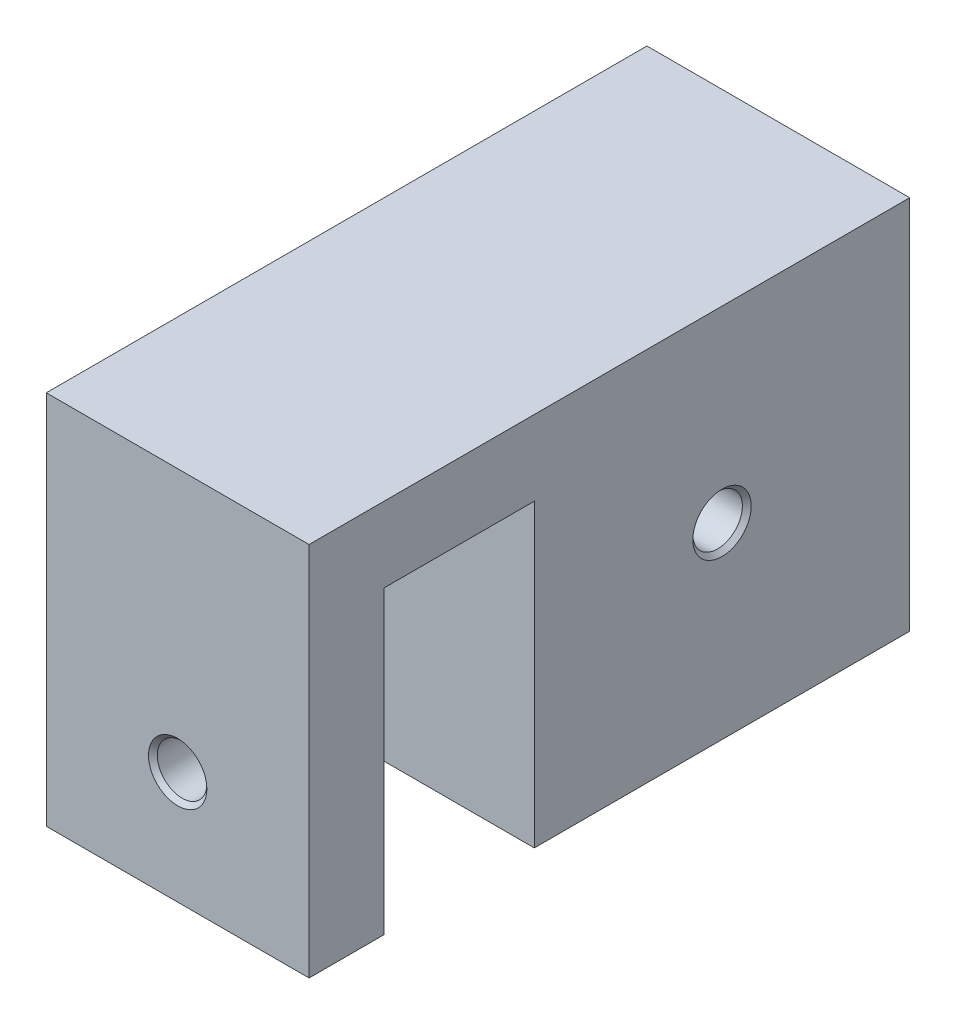
ISO-10303-21;
HEADER;
FILE_DESCRIPTION(('STEP AP214'),'2;1');
FILE_NAME('part.step','',(''),(''),'','','');
FILE_SCHEMA(('AUTOMOTIVE_DESIGN { 1 0 10303 214 1 1 1 1 }'));
ENDSEC;
DATA;
#1=APPLICATION_CONTEXT('core data for automotive mechanical design processes');
#2=APPLICATION_PROTOCOL_DEFINITION('international standard','automotive_design',2000,#1);
#3=PRODUCT_CONTEXT('',#1,'mechanical');
#4=PRODUCT('Part','Part','',(#3));
#5=PRODUCT_RELATED_PRODUCT_CATEGORY('part','',(#4));
#6=PRODUCT_DEFINITION_FORMATION('','',#4);
#7=PRODUCT_DEFINITION_CONTEXT('part definition',#1,'design');
#8=PRODUCT_DEFINITION('design','',#6,#7);
#9=PRODUCT_DEFINITION_SHAPE('','',#8);
#10=(LENGTH_UNIT() NAMED_UNIT(*) SI_UNIT(.MILLI.,.METRE.));
#11=(NAMED_UNIT(*) PLANE_ANGLE_UNIT() SI_UNIT($,.RADIAN.));
#12=(NAMED_UNIT(*) SI_UNIT($,.STERADIAN.) SOLID_ANGLE_UNIT());
#13=UNCERTAINTY_MEASURE_WITH_UNIT(LENGTH_MEASURE(1.E-05),#10,'distance_accuracy_value','');
#14=(GEOMETRIC_REPRESENTATION_CONTEXT(3) GLOBAL_UNCERTAINTY_ASSIGNED_CONTEXT((#13)) GLOBAL_UNIT_ASSIGNED_CONTEXT((#10,
#11,#12)) REPRESENTATION_CONTEXT('',''));
#15=CARTESIAN_POINT('',(0.,0.,0.));
#16=DIRECTION('',(0.,0.,1.));
#17=DIRECTION('',(1.,0.,0.));
#18=AXIS2_PLACEMENT_3D('',#15,#16,#17);
#19=CARTESIAN_POINT('',(35.,-10.,30.));
#20=DIRECTION('',(0.,1.,0.));
#21=DIRECTION('',(-1.,0.,0.));
#22=AXIS2_PLACEMENT_3D('',#19,#20,#21);
#23=PLANE('',#22);
#24=DIRECTION('',(1.,0.,0.));
#25=VECTOR('',#24,1.);
#26=CARTESIAN_POINT('',(0.,-10.,20.));
#27=LINE('',#26,#25);
#28=CARTESIAN_POINT('',(0.,-10.,20.));
#29=VERTEX_POINT('',#28);
#30=CARTESIAN_POINT('',(35.,-10.,20.));
#31=VERTEX_POINT('',#30);
#32=EDGE_CURVE('E140',#29,#31,#27,.T.);
#33=ORIENTED_EDGE('',*,*,#32,.F.);
#34=DIRECTION('',(0.,0.,-1.));
#35=VECTOR('',#34,1.);
#36=CARTESIAN_POINT('',(0.,-10.,30.));
#37=LINE('',#36,#35);
#38=CARTESIAN_POINT('',(0.,-10.,0.));
#39=VERTEX_POINT('',#38);
#40=EDGE_CURVE('E59',#29,#39,#37,.T.);
#41=ORIENTED_EDGE('',*,*,#40,.T.);
#42=DIRECTION('',(1.,0.,0.));
#43=VECTOR('',#42,1.);
#44=CARTESIAN_POINT('',(35.,-10.,0.));
#45=LINE('',#44,#43);
#46=CARTESIAN_POINT('',(35.,-10.,0.));
#47=VERTEX_POINT('',#46);
#48=EDGE_CURVE('E145',#39,#47,#45,.T.);
#49=ORIENTED_EDGE('',*,*,#48,.T.);
#50=DIRECTION('',(0.,0.,-1.));
#51=VECTOR('',#50,1.);
#52=CARTESIAN_POINT('',(35.,-10.,30.));
#53=LINE('',#52,#51);
#54=EDGE_CURVE('E163',#31,#47,#53,.T.);
#55=ORIENTED_EDGE('',*,*,#54,.F.);
#56=EDGE_LOOP('',(#33,#41,#49,#55));
#57=FACE_BOUND('',#56,.T.);
#58=ADVANCED_FACE('F41',(#57),#23,.F.);
#59=CARTESIAN_POINT('',(35.,0.,0.));
#60=DIRECTION('',(0.,0.,-1.));
#61=DIRECTION('',(0.,1.,0.));
#62=AXIS2_PLACEMENT_3D('',#59,#60,#61);
#63=PLANE('',#62);
#64=ORIENTED_EDGE('',*,*,#48,.F.);
#65=DIRECTION('',(0.,-1.,0.));
#66=VECTOR('',#65,1.);
#67=CARTESIAN_POINT('',(0.,0.,0.));
#68=LINE('',#67,#66);
#69=CARTESIAN_POINT('',(0.,-50.,0.));
#70=VERTEX_POINT('',#69);
#71=EDGE_CURVE('E182',#39,#70,#68,.T.);
#72=ORIENTED_EDGE('',*,*,#71,.T.);
#73=DIRECTION('',(-1.,0.,0.));
#74=VECTOR('',#73,1.);
#75=CARTESIAN_POINT('',(35.,-50.,0.));
#76=LINE('',#75,#74);
#77=CARTESIAN_POINT('',(35.,-50.,0.));
#78=VERTEX_POINT('',#77);
#79=EDGE_CURVE('E11',#78,#70,#76,.T.);
#80=ORIENTED_EDGE('',*,*,#79,.F.);
#81=DIRECTION('',(0.,-1.,0.));
#82=VECTOR('',#81,1.);
#83=CARTESIAN_POINT('',(35.,0.,0.));
#84=LINE('',#83,#82);
#85=EDGE_CURVE('E90',#47,#78,#84,.T.);
#86=ORIENTED_EDGE('',*,*,#85,.F.);
#87=EDGE_LOOP('',(#64,#72,#80,#86));
#88=FACE_BOUND('',#87,.T.);
#89=ADVANCED_FACE('F43',(#88),#63,.F.);
#90=CARTESIAN_POINT('',(35.,-50.,0.));
#91=DIRECTION('',(0.,1.,0.));
#92=DIRECTION('',(0.,0.,1.));
#93=AXIS2_PLACEMENT_3D('',#90,#91,#92);
#94=PLANE('',#93);
#95=DIRECTION('',(0.,0.,-1.));
#96=VECTOR('',#95,1.);
#97=CARTESIAN_POINT('',(0.,-50.,0.));
#98=LINE('',#97,#96);
#99=CARTESIAN_POINT('',(0.,-50.,-50.));
#100=VERTEX_POINT('',#99);
#101=EDGE_CURVE('E201',#70,#100,#98,.T.);
#102=ORIENTED_EDGE('',*,*,#101,.T.);
#103=DIRECTION('',(-1.,0.,0.));
#104=VECTOR('',#103,1.);
#105=CARTESIAN_POINT('',(35.,-50.,-50.));
#106=LINE('',#105,#104);
#107=CARTESIAN_POINT('',(35.,-50.,-50.));
#108=VERTEX_POINT('',#107);
#109=EDGE_CURVE('E51',#108,#100,#106,.T.);
#110=ORIENTED_EDGE('',*,*,#109,.F.);
#111=DIRECTION('',(0.,0.,-1.));
#112=VECTOR('',#111,1.);
#113=CARTESIAN_POINT('',(35.,-50.,0.));
#114=LINE('',#113,#112);
#115=EDGE_CURVE('E189',#78,#108,#114,.T.);
#116=ORIENTED_EDGE('',*,*,#115,.F.);
#117=ORIENTED_EDGE('',*,*,#79,.T.);
#118=EDGE_LOOP('',(#102,#110,#116,#117));
#119=FACE_BOUND('',#118,.T.);
#120=ADVANCED_FACE('F245',(#119),#94,.F.);
#121=CARTESIAN_POINT('',(35.,0.,-50.));
#122=DIRECTION('',(0.,0.,1.));
#123=DIRECTION('',(0.,-1.,0.));
#124=AXIS2_PLACEMENT_3D('',#121,#122,#123);
#125=PLANE('',#124);
#126=DIRECTION('',(0.,1.,0.));
#127=VECTOR('',#126,1.);
#128=CARTESIAN_POINT('',(0.,0.,-50.));
#129=LINE('',#128,#127);
#130=CARTESIAN_POINT('',(0.,0.,-50.));
#131=VERTEX_POINT('',#130);
#132=EDGE_CURVE('E85',#100,#131,#129,.T.);
#133=ORIENTED_EDGE('',*,*,#132,.T.);
#134=DIRECTION('',(-1.,0.,0.));
#135=VECTOR('',#134,1.);
#136=CARTESIAN_POINT('',(35.,0.,-50.));
#137=LINE('',#136,#135);
#138=CARTESIAN_POINT('',(35.,0.,-50.));
#139=VERTEX_POINT('',#138);
#140=EDGE_CURVE('E198',#139,#131,#137,.T.);
#141=ORIENTED_EDGE('',*,*,#140,.F.);
#142=DIRECTION('',(0.,1.,0.));
#143=VECTOR('',#142,1.);
#144=CARTESIAN_POINT('',(35.,0.,-50.));
#145=LINE('',#144,#143);
#146=EDGE_CURVE('E68',#108,#139,#145,.T.);
#147=ORIENTED_EDGE('',*,*,#146,.F.);
#148=ORIENTED_EDGE('',*,*,#109,.T.);
#149=EDGE_LOOP('',(#133,#141,#147,#148));
#150=FACE_BOUND('',#149,.T.);
#151=ADVANCED_FACE('F341',(#150),#125,.F.);
#152=CARTESIAN_POINT('',(35.,0.,0.));
#153=DIRECTION('',(0.,-1.,0.));
#154=DIRECTION('',(0.,0.,-1.));
#155=AXIS2_PLACEMENT_3D('',#152,#153,#154);
#156=PLANE('',#155);
#157=DIRECTION('',(0.,0.,1.));
#158=VECTOR('',#157,1.);
#159=CARTESIAN_POINT('',(0.,0.,0.));
#160=LINE('',#159,#158);
#161=CARTESIAN_POINT('',(0.,0.,30.));
#162=VERTEX_POINT('',#161);
#163=EDGE_CURVE('E190',#131,#162,#160,.T.);
#164=ORIENTED_EDGE('',*,*,#163,.T.);
#165=DIRECTION('',(-1.,0.,0.));
#166=VECTOR('',#165,1.);
#167=CARTESIAN_POINT('',(35.,0.,30.));
#168=LINE('',#167,#166);
#169=CARTESIAN_POINT('',(35.,0.,30.));
#170=VERTEX_POINT('',#169);
#171=EDGE_CURVE('E157',#170,#162,#168,.T.);
#172=ORIENTED_EDGE('',*,*,#171,.F.);
#173=DIRECTION('',(0.,0.,1.));
#174=VECTOR('',#173,1.);
#175=CARTESIAN_POINT('',(35.,0.,0.));
#176=LINE('',#175,#174);
#177=EDGE_CURVE('E195',#139,#170,#176,.T.);
#178=ORIENTED_EDGE('',*,*,#177,.F.);
#179=ORIENTED_EDGE('',*,*,#140,.T.);
#180=EDGE_LOOP('',(#164,#172,#178,#179));
#181=FACE_BOUND('',#180,.T.);
#182=ADVANCED_FACE('F236',(#181),#156,.F.);
#183=CARTESIAN_POINT('',(35.,0.,0.));
#184=DIRECTION('',(1.,0.,0.));
#185=DIRECTION('',(0.,0.,-1.));
#186=AXIS2_PLACEMENT_3D('',#183,#184,#185);
#187=PLANE('',#186);
#188=CARTESIAN_POINT('',(35.,-25.,-25.));
#189=DIRECTION('',(1.,0.,0.));
#190=DIRECTION('',(0.,0.,-1.));
#191=AXIS2_PLACEMENT_3D('',#188,#189,#190);
#192=CIRCLE('',#191,3.8865);
#193=CARTESIAN_POINT('',(35.,-25.,-28.8865));
#194=VERTEX_POINT('',#193);
#195=EDGE_CURVE('E169',#194,#194,#192,.T.);
#196=ORIENTED_EDGE('',*,*,#195,.F.);
#197=EDGE_LOOP('',(#196));
#198=FACE_BOUND('',#197,.T.);
#199=ORIENTED_EDGE('',*,*,#177,.T.);
#200=DIRECTION('',(0.,1.,0.));
#201=VECTOR('',#200,1.);
#202=CARTESIAN_POINT('',(35.,0.,30.));
#203=LINE('',#202,#201);
#204=CARTESIAN_POINT('',(35.,-50.,30.));
#205=VERTEX_POINT('',#204);
#206=EDGE_CURVE('E149',#205,#170,#203,.T.);
#207=ORIENTED_EDGE('',*,*,#206,.F.);
#208=DIRECTION('',(0.,0.,1.));
#209=VECTOR('',#208,1.);
#210=CARTESIAN_POINT('',(35.,-50.,30.));
#211=LINE('',#210,#209);
#212=CARTESIAN_POINT('',(35.,-50.,20.));
#213=VERTEX_POINT('',#212);
#214=EDGE_CURVE('E129',#213,#205,#211,.T.);
#215=ORIENTED_EDGE('',*,*,#214,.F.);
#216=DIRECTION('',(0.,1.,0.));
#217=VECTOR('',#216,1.);
#218=CARTESIAN_POINT('',(35.,-50.,20.));
#219=LINE('',#218,#217);
#220=EDGE_CURVE('E124',#213,#31,#219,.T.);
#221=ORIENTED_EDGE('',*,*,#220,.T.);
#222=ORIENTED_EDGE('',*,*,#54,.T.);
#223=ORIENTED_EDGE('',*,*,#85,.T.);
#224=ORIENTED_EDGE('',*,*,#115,.T.);
#225=ORIENTED_EDGE('',*,*,#146,.T.);
#226=EDGE_LOOP('',(#199,#207,#215,#221,#222,#223,#224,#225));
#227=FACE_BOUND('',#226,.T.);
#228=ADVANCED_FACE('F231',(#198,#227),#187,.T.);
#229=CARTESIAN_POINT('',(0.,0.,0.));
#230=DIRECTION('',(1.,0.,0.));
#231=DIRECTION('',(0.,0.,-1.));
#232=AXIS2_PLACEMENT_3D('',#229,#230,#231);
#233=PLANE('',#232);
#234=CARTESIAN_POINT('',(0.,-25.,-25.));
#235=DIRECTION('',(-1.,0.,0.));
#236=DIRECTION('',(0.,0.,1.));
#237=AXIS2_PLACEMENT_3D('',#234,#235,#236);
#238=CIRCLE('',#237,20.);
#239=CARTESIAN_POINT('',(0.,-25.,-5.));
#240=VERTEX_POINT('',#239);
#241=EDGE_CURVE('E183',#240,#240,#238,.T.);
#242=ORIENTED_EDGE('',*,*,#241,.F.);
#243=EDGE_LOOP('',(#242));
#244=FACE_BOUND('',#243,.T.);
#245=ORIENTED_EDGE('',*,*,#71,.F.);
#246=ORIENTED_EDGE('',*,*,#40,.F.);
#247=DIRECTION('',(0.,1.,0.));
#248=VECTOR('',#247,1.);
#249=CARTESIAN_POINT('',(0.,-50.,20.));
#250=LINE('',#249,#248);
#251=CARTESIAN_POINT('',(0.,-50.,20.));
#252=VERTEX_POINT('',#251);
#253=EDGE_CURVE('E122',#252,#29,#250,.T.);
#254=ORIENTED_EDGE('',*,*,#253,.F.);
#255=DIRECTION('',(0.,0.,-1.));
#256=VECTOR('',#255,1.);
#257=CARTESIAN_POINT('',(0.,-50.,30.));
#258=LINE('',#257,#256);
#259=CARTESIAN_POINT('',(0.,-50.,30.));
#260=VERTEX_POINT('',#259);
#261=EDGE_CURVE('E130',#260,#252,#258,.T.);
#262=ORIENTED_EDGE('',*,*,#261,.F.);
#263=DIRECTION('',(0.,-1.,0.));
#264=VECTOR('',#263,1.);
#265=CARTESIAN_POINT('',(0.,0.,30.));
#266=LINE('',#265,#264);
#267=EDGE_CURVE('E161',#162,#260,#266,.T.);
#268=ORIENTED_EDGE('',*,*,#267,.F.);
#269=ORIENTED_EDGE('',*,*,#163,.F.);
#270=ORIENTED_EDGE('',*,*,#132,.F.);
#271=ORIENTED_EDGE('',*,*,#101,.F.);
#272=EDGE_LOOP('',(#245,#246,#254,#262,#268,#269,#270,#271));
#273=FACE_BOUND('',#272,.T.);
#274=ADVANCED_FACE('F143',(#244,#273),#233,.F.);
#275=CARTESIAN_POINT('',(20.,-25.,-25.));
#276=DIRECTION('',(-1.,0.,0.));
#277=DIRECTION('',(0.,0.,1.));
#278=AXIS2_PLACEMENT_3D('',#275,#276,#277);
#279=CYLINDRICAL_SURFACE('',#278,20.);
#280=CARTESIAN_POINT('',(20.,-25.,-25.));
#281=DIRECTION('',(-1.,0.,0.));
#282=DIRECTION('',(0.,0.,1.));
#283=AXIS2_PLACEMENT_3D('',#280,#281,#282);
#284=CIRCLE('',#283,20.);
#285=CARTESIAN_POINT('',(20.,-25.,-5.));
#286=VERTEX_POINT('',#285);
#287=EDGE_CURVE('E178',#286,#286,#284,.T.);
#288=ORIENTED_EDGE('',*,*,#287,.F.);
#289=EDGE_LOOP('',(#288));
#290=FACE_BOUND('',#289,.T.);
#291=ORIENTED_EDGE('',*,*,#241,.T.);
#292=EDGE_LOOP('',(#291));
#293=FACE_BOUND('',#292,.T.);
#294=ADVANCED_FACE('F221',(#290,#293),#279,.F.);
#295=CARTESIAN_POINT('',(20.,-25.,-25.));
#296=DIRECTION('',(-1.,0.,0.));
#297=DIRECTION('',(0.,0.,1.));
#298=AXIS2_PLACEMENT_3D('',#295,#296,#297);
#299=PLANE('',#298);
#300=CARTESIAN_POINT('',(20.,-25.,-25.));
#301=DIRECTION('',(-1.,0.,0.));
#302=DIRECTION('',(0.,0.,1.));
#303=AXIS2_PLACEMENT_3D('',#300,#301,#302);
#304=CIRCLE('',#303,3.29999999999999);
#305=CARTESIAN_POINT('',(20.,-25.,-21.7));
#306=VERTEX_POINT('',#305);
#307=EDGE_CURVE('E177',#306,#306,#304,.T.);
#308=ORIENTED_EDGE('',*,*,#307,.F.);
#309=EDGE_LOOP('',(#308));
#310=FACE_BOUND('',#309,.T.);
#311=ORIENTED_EDGE('',*,*,#287,.T.);
#312=EDGE_LOOP('',(#311));
#313=FACE_BOUND('',#312,.T.);
#314=ADVANCED_FACE('F218',(#310,#313),#299,.T.);
#315=CARTESIAN_POINT('',(35.,-25.,-25.));
#316=DIRECTION('',(1.,0.,0.));
#317=DIRECTION('',(0.,0.,-1.));
#318=AXIS2_PLACEMENT_3D('',#315,#316,#317);
#319=CYLINDRICAL_SURFACE('',#318,3.29999999999999);
#320=ORIENTED_EDGE('',*,*,#307,.T.);
#321=EDGE_LOOP('',(#320));
#322=FACE_BOUND('',#321,.T.);
#323=CARTESIAN_POINT('',(34.4135,-25.,-25.));
#324=DIRECTION('',(1.,0.,0.));
#325=DIRECTION('',(0.,0.,-1.));
#326=AXIS2_PLACEMENT_3D('',#323,#324,#325);
#327=CIRCLE('',#326,3.3);
#328=CARTESIAN_POINT('',(34.4135,-25.,-28.3));
#329=VERTEX_POINT('',#328);
#330=EDGE_CURVE('E173',#329,#329,#327,.T.);
#331=ORIENTED_EDGE('',*,*,#330,.T.);
#332=EDGE_LOOP('',(#331));
#333=FACE_BOUND('',#332,.T.);
#334=ADVANCED_FACE('F215',(#322,#333),#319,.F.);
#335=CARTESIAN_POINT('',(35.,-25.,-25.));
#336=DIRECTION('',(1.,0.,0.));
#337=DIRECTION('',(0.,0.,-1.));
#338=AXIS2_PLACEMENT_3D('',#335,#336,#337);
#339=CONICAL_SURFACE('',#338,3.8865,0.785398163397448);
#340=ORIENTED_EDGE('',*,*,#330,.F.);
#341=EDGE_LOOP('',(#340));
#342=FACE_BOUND('',#341,.T.);
#343=ORIENTED_EDGE('',*,*,#195,.T.);
#344=EDGE_LOOP('',(#343));
#345=FACE_BOUND('',#344,.T.);
#346=ADVANCED_FACE('F251',(#342,#345),#339,.F.);
#347=CARTESIAN_POINT('',(0.,0.,30.));
#348=DIRECTION('',(0.,0.,-1.));
#349=DIRECTION('',(-1.,0.,0.));
#350=AXIS2_PLACEMENT_3D('',#347,#348,#349);
#351=PLANE('',#350);
#352=CARTESIAN_POINT('',(17.5,-35.,30.));
#353=DIRECTION('',(0.,0.,1.));
#354=DIRECTION('',(1.,0.,0.));
#355=AXIS2_PLACEMENT_3D('',#352,#353,#354);
#356=CIRCLE('',#355,3.8865);
#357=CARTESIAN_POINT('',(21.3865,-35.,30.));
#358=VERTEX_POINT('',#357);
#359=EDGE_CURVE('E408',#358,#358,#356,.T.);
#360=ORIENTED_EDGE('',*,*,#359,.F.);
#361=EDGE_LOOP('',(#360));
#362=FACE_BOUND('',#361,.T.);
#363=ORIENTED_EDGE('',*,*,#206,.T.);
#364=ORIENTED_EDGE('',*,*,#171,.T.);
#365=ORIENTED_EDGE('',*,*,#267,.T.);
#366=DIRECTION('',(-1.,0.,0.));
#367=VECTOR('',#366,1.);
#368=CARTESIAN_POINT('',(0.,-50.,30.));
#369=LINE('',#368,#367);
#370=EDGE_CURVE('E136',#205,#260,#369,.T.);
#371=ORIENTED_EDGE('',*,*,#370,.F.);
#372=EDGE_LOOP('',(#363,#364,#365,#371));
#373=FACE_BOUND('',#372,.T.);
#374=ADVANCED_FACE('F249',(#362,#373),#351,.F.);
#375=CARTESIAN_POINT('',(0.,-50.,20.));
#376=DIRECTION('',(0.,0.,1.));
#377=DIRECTION('',(1.,0.,0.));
#378=AXIS2_PLACEMENT_3D('',#375,#376,#377);
#379=PLANE('',#378);
#380=CARTESIAN_POINT('',(17.5,-35.,20.));
#381=DIRECTION('',(0.,0.,1.));
#382=DIRECTION('',(1.,0.,0.));
#383=AXIS2_PLACEMENT_3D('',#380,#381,#382);
#384=CIRCLE('',#383,3.29999999999999);
#385=CARTESIAN_POINT('',(20.8,-35.,20.));
#386=VERTEX_POINT('',#385);
#387=EDGE_CURVE('E45',#386,#386,#384,.T.);
#388=ORIENTED_EDGE('',*,*,#387,.T.);
#389=EDGE_LOOP('',(#388));
#390=FACE_BOUND('',#389,.T.);
#391=ORIENTED_EDGE('',*,*,#32,.T.);
#392=ORIENTED_EDGE('',*,*,#220,.F.);
#393=DIRECTION('',(1.,0.,0.));
#394=VECTOR('',#393,1.);
#395=CARTESIAN_POINT('',(0.,-50.,20.));
#396=LINE('',#395,#394);
#397=EDGE_CURVE('E118',#252,#213,#396,.T.);
#398=ORIENTED_EDGE('',*,*,#397,.F.);
#399=ORIENTED_EDGE('',*,*,#253,.T.);
#400=EDGE_LOOP('',(#391,#392,#398,#399));
#401=FACE_BOUND('',#400,.T.);
#402=ADVANCED_FACE('F120',(#390,#401),#379,.F.);
#403=CARTESIAN_POINT('',(0.,-50.,0.));
#404=DIRECTION('',(0.,-1.,0.));
#405=DIRECTION('',(1.,0.,0.));
#406=AXIS2_PLACEMENT_3D('',#403,#404,#405);
#407=PLANE('',#406);
#408=ORIENTED_EDGE('',*,*,#261,.T.);
#409=ORIENTED_EDGE('',*,*,#397,.T.);
#410=ORIENTED_EDGE('',*,*,#214,.T.);
#411=ORIENTED_EDGE('',*,*,#370,.T.);
#412=EDGE_LOOP('',(#408,#409,#410,#411));
#413=FACE_BOUND('',#412,.T.);
#414=ADVANCED_FACE('F134',(#413),#407,.T.);
#415=CARTESIAN_POINT('',(17.5,-35.,30.));
#416=DIRECTION('',(0.,0.,1.));
#417=DIRECTION('',(1.,0.,0.));
#418=AXIS2_PLACEMENT_3D('',#415,#416,#417);
#419=CYLINDRICAL_SURFACE('',#418,3.29999999999999);
#420=CARTESIAN_POINT('',(17.5,-35.,29.4135));
#421=DIRECTION('',(0.,0.,1.));
#422=DIRECTION('',(1.,0.,0.));
#423=AXIS2_PLACEMENT_3D('',#420,#421,#422);
#424=CIRCLE('',#423,3.3);
#425=CARTESIAN_POINT('',(20.8,-35.,29.4135));
#426=VERTEX_POINT('',#425);
#427=EDGE_CURVE('E404',#426,#426,#424,.T.);
#428=ORIENTED_EDGE('',*,*,#427,.T.);
#429=EDGE_LOOP('',(#428));
#430=FACE_BOUND('',#429,.T.);
#431=ORIENTED_EDGE('',*,*,#387,.F.);
#432=EDGE_LOOP('',(#431));
#433=FACE_BOUND('',#432,.T.);
#434=ADVANCED_FACE('F285',(#430,#433),#419,.F.);
#435=CARTESIAN_POINT('',(17.5,-35.,30.));
#436=DIRECTION('',(0.,0.,1.));
#437=DIRECTION('',(1.,0.,0.));
#438=AXIS2_PLACEMENT_3D('',#435,#436,#437);
#439=CONICAL_SURFACE('',#438,3.8865,0.785398163397448);
#440=ORIENTED_EDGE('',*,*,#427,.F.);
#441=EDGE_LOOP('',(#440));
#442=FACE_BOUND('',#441,.T.);
#443=ORIENTED_EDGE('',*,*,#359,.T.);
#444=EDGE_LOOP('',(#443));
#445=FACE_BOUND('',#444,.T.);
#446=ADVANCED_FACE('F291',(#442,#445),#439,.F.);
#447=CLOSED_SHELL('',(#58,#89,#120,#151,#182,#228,#274,#294,#314,#334,#346,#374,#402,#414,#434,#446));
#448=MANIFOLD_SOLID_BREP('B2',#447);
#449=ADVANCED_BREP_SHAPE_REPRESENTATION('',(#18,#448),#14);
#450=SHAPE_DEFINITION_REPRESENTATION(#9,#449);
ENDSEC;
END-ISO-10303-21;
